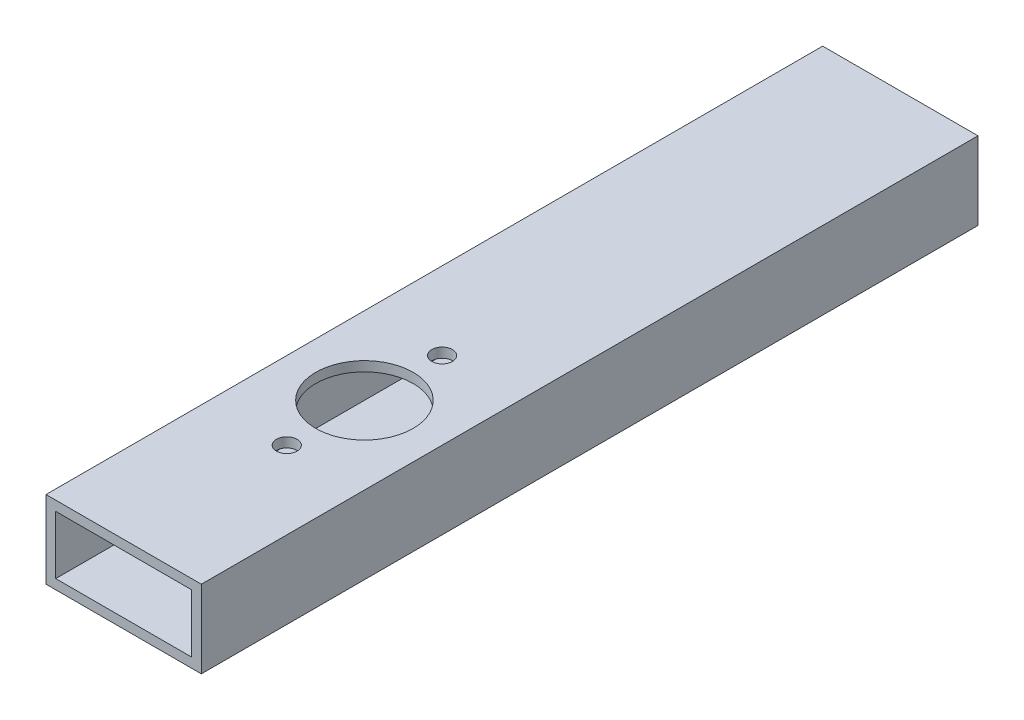
ISO-10303-21;
HEADER;
FILE_DESCRIPTION(('STEP AP214'),'2;1');
FILE_NAME('part.step','',(''),(''),'','','');
FILE_SCHEMA(('AUTOMOTIVE_DESIGN { 1 0 10303 214 1 1 1 1 }'));
ENDSEC;
DATA;
#1=APPLICATION_CONTEXT('core data for automotive mechanical design processes');
#2=APPLICATION_PROTOCOL_DEFINITION('international standard','automotive_design',2000,#1);
#3=PRODUCT_CONTEXT('',#1,'mechanical');
#4=PRODUCT('Part','Part','',(#3));
#5=PRODUCT_RELATED_PRODUCT_CATEGORY('part','',(#4));
#6=PRODUCT_DEFINITION_FORMATION('','',#4);
#7=PRODUCT_DEFINITION_CONTEXT('part definition',#1,'design');
#8=PRODUCT_DEFINITION('design','',#6,#7);
#9=PRODUCT_DEFINITION_SHAPE('','',#8);
#10=(LENGTH_UNIT() NAMED_UNIT(*) SI_UNIT(.MILLI.,.METRE.));
#11=(NAMED_UNIT(*) PLANE_ANGLE_UNIT() SI_UNIT($,.RADIAN.));
#12=(NAMED_UNIT(*) SI_UNIT($,.STERADIAN.) SOLID_ANGLE_UNIT());
#13=UNCERTAINTY_MEASURE_WITH_UNIT(LENGTH_MEASURE(1.E-05),#10,'distance_accuracy_value','');
#14=(GEOMETRIC_REPRESENTATION_CONTEXT(3) GLOBAL_UNCERTAINTY_ASSIGNED_CONTEXT((#13)) GLOBAL_UNIT_ASSIGNED_CONTEXT((#10,
#11,#12)) REPRESENTATION_CONTEXT('',''));
#15=CARTESIAN_POINT('',(0.,0.,0.));
#16=DIRECTION('',(0.,0.,1.));
#17=DIRECTION('',(1.,0.,0.));
#18=AXIS2_PLACEMENT_3D('',#15,#16,#17);
#19=CARTESIAN_POINT('',(0.,-247.572549455374,73.66));
#20=DIRECTION('',(0.,1.,0.));
#21=DIRECTION('',(1.,0.,0.));
#22=AXIS2_PLACEMENT_3D('',#19,#20,#21);
#23=CYLINDRICAL_SURFACE('',#22,3.3782);
#24=CARTESIAN_POINT('',(0.,12.7,73.66));
#25=DIRECTION('',(0.,-1.,0.));
#26=DIRECTION('',(0.,0.,-1.));
#27=AXIS2_PLACEMENT_3D('',#24,#25,#26);
#28=CIRCLE('',#27,3.3782);
#29=CARTESIAN_POINT('',(0.,12.7,70.2818));
#30=VERTEX_POINT('',#29);
#31=EDGE_CURVE('E143',#30,#30,#28,.T.);
#32=ORIENTED_EDGE('',*,*,#31,.F.);
#33=EDGE_LOOP('',(#32));
#34=FACE_BOUND('',#33,.T.);
#35=CARTESIAN_POINT('',(0.,9.52500000000001,73.66));
#36=DIRECTION('',(0.,1.,0.));
#37=DIRECTION('',(1.,0.,0.));
#38=AXIS2_PLACEMENT_3D('',#35,#36,#37);
#39=CIRCLE('',#38,3.3782);
#40=CARTESIAN_POINT('',(3.3782,9.52500000000001,73.66));
#41=VERTEX_POINT('',#40);
#42=EDGE_CURVE('E147',#41,#41,#39,.T.);
#43=ORIENTED_EDGE('',*,*,#42,.F.);
#44=EDGE_LOOP('',(#43));
#45=FACE_BOUND('',#44,.T.);
#46=ADVANCED_FACE('F16',(#34,#45),#23,.F.);
#47=CARTESIAN_POINT('',(0.,-247.572549455374,73.66));
#48=DIRECTION('',(0.,1.,0.));
#49=DIRECTION('',(1.,0.,0.));
#50=AXIS2_PLACEMENT_3D('',#47,#48,#49);
#51=CYLINDRICAL_SURFACE('',#50,3.3782);
#52=CARTESIAN_POINT('',(0.,-9.52500000000001,73.66));
#53=DIRECTION('',(0.,-1.,0.));
#54=DIRECTION('',(0.,0.,-1.));
#55=AXIS2_PLACEMENT_3D('',#52,#53,#54);
#56=CIRCLE('',#55,3.3782);
#57=CARTESIAN_POINT('',(0.,-9.52500000000001,70.2818));
#58=VERTEX_POINT('',#57);
#59=EDGE_CURVE('E139',#58,#58,#56,.T.);
#60=ORIENTED_EDGE('',*,*,#59,.F.);
#61=EDGE_LOOP('',(#60));
#62=FACE_BOUND('',#61,.T.);
#63=CARTESIAN_POINT('',(0.,-12.7,73.66));
#64=DIRECTION('',(0.,1.,0.));
#65=DIRECTION('',(1.,0.,0.));
#66=AXIS2_PLACEMENT_3D('',#63,#64,#65);
#67=CIRCLE('',#66,3.3782);
#68=CARTESIAN_POINT('',(3.3782,-12.7,73.66));
#69=VERTEX_POINT('',#68);
#70=EDGE_CURVE('E129',#69,#69,#67,.T.);
#71=ORIENTED_EDGE('',*,*,#70,.F.);
#72=EDGE_LOOP('',(#71));
#73=FACE_BOUND('',#72,.T.);
#74=ADVANCED_FACE('F192',(#62,#73),#51,.F.);
#75=CARTESIAN_POINT('',(0.,-247.572549455374,22.86));
#76=DIRECTION('',(0.,1.,0.));
#77=DIRECTION('',(1.,0.,0.));
#78=AXIS2_PLACEMENT_3D('',#75,#76,#77);
#79=CYLINDRICAL_SURFACE('',#78,3.3782);
#80=CARTESIAN_POINT('',(0.,12.7,22.86));
#81=DIRECTION('',(0.,-1.,0.));
#82=DIRECTION('',(0.,0.,-1.));
#83=AXIS2_PLACEMENT_3D('',#80,#81,#82);
#84=CIRCLE('',#83,3.3782);
#85=CARTESIAN_POINT('',(0.,12.7,19.4818));
#86=VERTEX_POINT('',#85);
#87=EDGE_CURVE('E105',#86,#86,#84,.T.);
#88=ORIENTED_EDGE('',*,*,#87,.F.);
#89=EDGE_LOOP('',(#88));
#90=FACE_BOUND('',#89,.T.);
#91=CARTESIAN_POINT('',(0.,9.52500000000001,22.86));
#92=DIRECTION('',(0.,1.,0.));
#93=DIRECTION('',(1.,0.,0.));
#94=AXIS2_PLACEMENT_3D('',#91,#92,#93);
#95=CIRCLE('',#94,3.3782);
#96=CARTESIAN_POINT('',(3.3782,9.52500000000001,22.86));
#97=VERTEX_POINT('',#96);
#98=EDGE_CURVE('E144',#97,#97,#95,.T.);
#99=ORIENTED_EDGE('',*,*,#98,.F.);
#100=EDGE_LOOP('',(#99));
#101=FACE_BOUND('',#100,.T.);
#102=ADVANCED_FACE('F199',(#90,#101),#79,.F.);
#103=CARTESIAN_POINT('',(0.,-247.572549455374,22.86));
#104=DIRECTION('',(0.,1.,0.));
#105=DIRECTION('',(1.,0.,0.));
#106=AXIS2_PLACEMENT_3D('',#103,#104,#105);
#107=CYLINDRICAL_SURFACE('',#106,3.3782);
#108=CARTESIAN_POINT('',(0.,-9.52500000000001,22.86));
#109=DIRECTION('',(0.,-1.,0.));
#110=DIRECTION('',(0.,0.,-1.));
#111=AXIS2_PLACEMENT_3D('',#108,#109,#110);
#112=CIRCLE('',#111,3.3782);
#113=CARTESIAN_POINT('',(0.,-9.52500000000001,19.4818));
#114=VERTEX_POINT('',#113);
#115=EDGE_CURVE('E149',#114,#114,#112,.T.);
#116=ORIENTED_EDGE('',*,*,#115,.F.);
#117=EDGE_LOOP('',(#116));
#118=FACE_BOUND('',#117,.T.);
#119=CARTESIAN_POINT('',(0.,-12.7,22.86));
#120=DIRECTION('',(0.,1.,0.));
#121=DIRECTION('',(1.,0.,0.));
#122=AXIS2_PLACEMENT_3D('',#119,#120,#121);
#123=CIRCLE('',#122,3.3782);
#124=CARTESIAN_POINT('',(3.3782,-12.7,22.86));
#125=VERTEX_POINT('',#124);
#126=EDGE_CURVE('E131',#125,#125,#123,.T.);
#127=ORIENTED_EDGE('',*,*,#126,.F.);
#128=EDGE_LOOP('',(#127));
#129=FACE_BOUND('',#128,.T.);
#130=ADVANCED_FACE('F205',(#118,#129),#107,.F.);
#131=CARTESIAN_POINT('',(0.,-12.7,48.26));
#132=DIRECTION('',(0.,1.,0.));
#133=DIRECTION('',(1.,0.,0.));
#134=AXIS2_PLACEMENT_3D('',#131,#132,#133);
#135=CYLINDRICAL_SURFACE('',#134,7.9375);
#136=CARTESIAN_POINT('',(0.,-12.7,48.26));
#137=DIRECTION('',(0.,1.,0.));
#138=DIRECTION('',(1.,0.,0.));
#139=AXIS2_PLACEMENT_3D('',#136,#137,#138);
#140=CIRCLE('',#139,7.9375);
#141=CARTESIAN_POINT('',(7.9375,-12.7,48.26));
#142=VERTEX_POINT('',#141);
#143=EDGE_CURVE('E115',#142,#142,#140,.T.);
#144=ORIENTED_EDGE('',*,*,#143,.F.);
#145=EDGE_LOOP('',(#144));
#146=FACE_BOUND('',#145,.T.);
#147=CARTESIAN_POINT('',(0.,-9.525,48.26));
#148=DIRECTION('',(0.,-1.,0.));
#149=DIRECTION('',(0.,0.,-1.));
#150=AXIS2_PLACEMENT_3D('',#147,#148,#149);
#151=CIRCLE('',#150,7.9375);
#152=CARTESIAN_POINT('',(0.,-9.525,40.3225));
#153=VERTEX_POINT('',#152);
#154=EDGE_CURVE('E151',#153,#153,#151,.T.);
#155=ORIENTED_EDGE('',*,*,#154,.F.);
#156=EDGE_LOOP('',(#155));
#157=FACE_BOUND('',#156,.T.);
#158=ADVANCED_FACE('F209',(#146,#157),#135,.F.);
#159=CARTESIAN_POINT('',(0.,12.7,48.26));
#160=DIRECTION('',(0.,-1.,0.));
#161=DIRECTION('',(0.,0.,-1.));
#162=AXIS2_PLACEMENT_3D('',#159,#160,#161);
#163=CYLINDRICAL_SURFACE('',#162,15.9131);
#164=CARTESIAN_POINT('',(0.,12.7,48.26));
#165=DIRECTION('',(0.,-1.,0.));
#166=DIRECTION('',(0.,0.,-1.));
#167=AXIS2_PLACEMENT_3D('',#164,#165,#166);
#168=CIRCLE('',#167,15.9131);
#169=CARTESIAN_POINT('',(0.,12.7,32.3469));
#170=VERTEX_POINT('',#169);
#171=EDGE_CURVE('E102',#170,#170,#168,.T.);
#172=ORIENTED_EDGE('',*,*,#171,.F.);
#173=EDGE_LOOP('',(#172));
#174=FACE_BOUND('',#173,.T.);
#175=CARTESIAN_POINT('',(0.,9.525,48.26));
#176=DIRECTION('',(0.,1.,0.));
#177=DIRECTION('',(1.,0.,0.));
#178=AXIS2_PLACEMENT_3D('',#175,#176,#177);
#179=CIRCLE('',#178,15.9131);
#180=CARTESIAN_POINT('',(15.9131,9.525,48.26));
#181=VERTEX_POINT('',#180);
#182=EDGE_CURVE('E148',#181,#181,#179,.T.);
#183=ORIENTED_EDGE('',*,*,#182,.F.);
#184=EDGE_LOOP('',(#183));
#185=FACE_BOUND('',#184,.T.);
#186=ADVANCED_FACE('F18',(#174,#185),#163,.F.);
#187=CARTESIAN_POINT('',(22.225,9.525,0.));
#188=DIRECTION('',(1.,0.,0.));
#189=DIRECTION('',(0.,0.,-1.));
#190=AXIS2_PLACEMENT_3D('',#187,#188,#189);
#191=PLANE('',#190);
#192=DIRECTION('',(0.,-1.,0.));
#193=VECTOR('',#192,1.);
#194=CARTESIAN_POINT('',(22.225,4.7625,127.));
#195=LINE('',#194,#193);
#196=CARTESIAN_POINT('',(22.225,9.525,127.));
#197=VERTEX_POINT('',#196);
#198=CARTESIAN_POINT('',(22.225,-9.525,127.));
#199=VERTEX_POINT('',#198);
#200=EDGE_CURVE('E34',#197,#199,#195,.T.);
#201=ORIENTED_EDGE('',*,*,#200,.F.);
#202=DIRECTION('',(0.,0.,-1.));
#203=VECTOR('',#202,1.);
#204=CARTESIAN_POINT('',(22.225,9.525,0.));
#205=LINE('',#204,#203);
#206=CARTESIAN_POINT('',(22.225,9.525,-127.));
#207=VERTEX_POINT('',#206);
#208=EDGE_CURVE('E10',#197,#207,#205,.T.);
#209=ORIENTED_EDGE('',*,*,#208,.T.);
#210=DIRECTION('',(0.,1.,0.));
#211=VECTOR('',#210,1.);
#212=CARTESIAN_POINT('',(22.225,4.7625,-127.));
#213=LINE('',#212,#211);
#214=CARTESIAN_POINT('',(22.225,-9.525,-127.));
#215=VERTEX_POINT('',#214);
#216=EDGE_CURVE('E160',#215,#207,#213,.T.);
#217=ORIENTED_EDGE('',*,*,#216,.F.);
#218=DIRECTION('',(0.,0.,1.));
#219=VECTOR('',#218,1.);
#220=CARTESIAN_POINT('',(22.225,-9.525,0.));
#221=LINE('',#220,#219);
#222=EDGE_CURVE('E26',#215,#199,#221,.T.);
#223=ORIENTED_EDGE('',*,*,#222,.T.);
#224=EDGE_LOOP('',(#201,#209,#217,#223));
#225=FACE_BOUND('',#224,.T.);
#226=ADVANCED_FACE('F211',(#225),#191,.F.);
#227=CARTESIAN_POINT('',(22.225,-9.525,0.));
#228=DIRECTION('',(0.,-1.,0.));
#229=DIRECTION('',(0.,0.,-1.));
#230=AXIS2_PLACEMENT_3D('',#227,#228,#229);
#231=PLANE('',#230);
#232=ORIENTED_EDGE('',*,*,#59,.T.);
#233=EDGE_LOOP('',(#232));
#234=FACE_BOUND('',#233,.T.);
#235=ORIENTED_EDGE('',*,*,#115,.T.);
#236=EDGE_LOOP('',(#235));
#237=FACE_BOUND('',#236,.T.);
#238=ORIENTED_EDGE('',*,*,#154,.T.);
#239=EDGE_LOOP('',(#238));
#240=FACE_BOUND('',#239,.T.);
#241=DIRECTION('',(-1.,0.,0.));
#242=VECTOR('',#241,1.);
#243=CARTESIAN_POINT('',(11.1125,-9.525,127.));
#244=LINE('',#243,#242);
#245=CARTESIAN_POINT('',(-22.225,-9.525,127.));
#246=VERTEX_POINT('',#245);
#247=EDGE_CURVE('E161',#199,#246,#244,.T.);
#248=ORIENTED_EDGE('',*,*,#247,.F.);
#249=ORIENTED_EDGE('',*,*,#222,.F.);
#250=DIRECTION('',(1.,0.,0.));
#251=VECTOR('',#250,1.);
#252=CARTESIAN_POINT('',(11.1125,-9.525,-127.));
#253=LINE('',#252,#251);
#254=CARTESIAN_POINT('',(-22.225,-9.525,-127.));
#255=VERTEX_POINT('',#254);
#256=EDGE_CURVE('E122',#255,#215,#253,.T.);
#257=ORIENTED_EDGE('',*,*,#256,.F.);
#258=DIRECTION('',(0.,0.,1.));
#259=VECTOR('',#258,1.);
#260=CARTESIAN_POINT('',(-22.225,-9.525,0.));
#261=LINE('',#260,#259);
#262=EDGE_CURVE('E156',#255,#246,#261,.T.);
#263=ORIENTED_EDGE('',*,*,#262,.T.);
#264=EDGE_LOOP('',(#248,#249,#257,#263));
#265=FACE_BOUND('',#264,.T.);
#266=ADVANCED_FACE('F214',(#234,#237,#240,#265),#231,.F.);
#267=CARTESIAN_POINT('',(-22.225,-9.525,0.));
#268=DIRECTION('',(-1.,0.,0.));
#269=DIRECTION('',(0.,0.,1.));
#270=AXIS2_PLACEMENT_3D('',#267,#268,#269);
#271=PLANE('',#270);
#272=DIRECTION('',(0.,1.,0.));
#273=VECTOR('',#272,1.);
#274=CARTESIAN_POINT('',(-22.225,-4.7625,127.));
#275=LINE('',#274,#273);
#276=CARTESIAN_POINT('',(-22.225,9.525,127.));
#277=VERTEX_POINT('',#276);
#278=EDGE_CURVE('E166',#246,#277,#275,.T.);
#279=ORIENTED_EDGE('',*,*,#278,.F.);
#280=ORIENTED_EDGE('',*,*,#262,.F.);
#281=DIRECTION('',(0.,-1.,0.));
#282=VECTOR('',#281,1.);
#283=CARTESIAN_POINT('',(-22.225,-4.7625,-127.));
#284=LINE('',#283,#282);
#285=CARTESIAN_POINT('',(-22.225,9.525,-127.));
#286=VERTEX_POINT('',#285);
#287=EDGE_CURVE('E126',#286,#255,#284,.T.);
#288=ORIENTED_EDGE('',*,*,#287,.F.);
#289=DIRECTION('',(0.,0.,1.));
#290=VECTOR('',#289,1.);
#291=CARTESIAN_POINT('',(-22.225,9.525,0.));
#292=LINE('',#291,#290);
#293=EDGE_CURVE('E170',#286,#277,#292,.T.);
#294=ORIENTED_EDGE('',*,*,#293,.T.);
#295=EDGE_LOOP('',(#279,#280,#288,#294));
#296=FACE_BOUND('',#295,.T.);
#297=ADVANCED_FACE('F217',(#296),#271,.F.);
#298=CARTESIAN_POINT('',(-22.225,9.525,0.));
#299=DIRECTION('',(0.,1.,0.));
#300=DIRECTION('',(0.,0.,1.));
#301=AXIS2_PLACEMENT_3D('',#298,#299,#300);
#302=PLANE('',#301);
#303=ORIENTED_EDGE('',*,*,#42,.T.);
#304=EDGE_LOOP('',(#303));
#305=FACE_BOUND('',#304,.T.);
#306=ORIENTED_EDGE('',*,*,#98,.T.);
#307=EDGE_LOOP('',(#306));
#308=FACE_BOUND('',#307,.T.);
#309=ORIENTED_EDGE('',*,*,#182,.T.);
#310=EDGE_LOOP('',(#309));
#311=FACE_BOUND('',#310,.T.);
#312=DIRECTION('',(1.,0.,0.));
#313=VECTOR('',#312,1.);
#314=CARTESIAN_POINT('',(-11.1125,9.525,127.));
#315=LINE('',#314,#313);
#316=EDGE_CURVE('E172',#277,#197,#315,.T.);
#317=ORIENTED_EDGE('',*,*,#316,.F.);
#318=ORIENTED_EDGE('',*,*,#293,.F.);
#319=DIRECTION('',(-1.,0.,0.));
#320=VECTOR('',#319,1.);
#321=CARTESIAN_POINT('',(-11.1125,9.525,-127.));
#322=LINE('',#321,#320);
#323=EDGE_CURVE('E164',#207,#286,#322,.T.);
#324=ORIENTED_EDGE('',*,*,#323,.F.);
#325=ORIENTED_EDGE('',*,*,#208,.F.);
#326=EDGE_LOOP('',(#317,#318,#324,#325));
#327=FACE_BOUND('',#326,.T.);
#328=ADVANCED_FACE('F188',(#305,#308,#311,#327),#302,.F.);
#329=CARTESIAN_POINT('',(0.,0.,-127.));
#330=DIRECTION('',(0.,0.,1.));
#331=DIRECTION('',(1.,0.,0.));
#332=AXIS2_PLACEMENT_3D('',#329,#330,#331);
#333=PLANE('',#332);
#334=ORIENTED_EDGE('',*,*,#216,.T.);
#335=ORIENTED_EDGE('',*,*,#323,.T.);
#336=ORIENTED_EDGE('',*,*,#287,.T.);
#337=ORIENTED_EDGE('',*,*,#256,.T.);
#338=EDGE_LOOP('',(#334,#335,#336,#337));
#339=FACE_BOUND('',#338,.T.);
#340=DIRECTION('',(0.,-1.,0.));
#341=VECTOR('',#340,1.);
#342=CARTESIAN_POINT('',(-25.4,-12.7,-127.));
#343=LINE('',#342,#341);
#344=CARTESIAN_POINT('',(-25.4,12.7,-127.));
#345=VERTEX_POINT('',#344);
#346=CARTESIAN_POINT('',(-25.4,-12.7,-127.));
#347=VERTEX_POINT('',#346);
#348=EDGE_CURVE('E96',#345,#347,#343,.T.);
#349=ORIENTED_EDGE('',*,*,#348,.F.);
#350=DIRECTION('',(-1.,0.,0.));
#351=VECTOR('',#350,1.);
#352=CARTESIAN_POINT('',(-25.4,12.7,-127.));
#353=LINE('',#352,#351);
#354=CARTESIAN_POINT('',(25.4,12.7,-127.));
#355=VERTEX_POINT('',#354);
#356=EDGE_CURVE('E88',#355,#345,#353,.T.);
#357=ORIENTED_EDGE('',*,*,#356,.F.);
#358=DIRECTION('',(0.,1.,0.));
#359=VECTOR('',#358,1.);
#360=CARTESIAN_POINT('',(25.4,12.7,-127.));
#361=LINE('',#360,#359);
#362=CARTESIAN_POINT('',(25.4,-12.7,-127.));
#363=VERTEX_POINT('',#362);
#364=EDGE_CURVE('E121',#363,#355,#361,.T.);
#365=ORIENTED_EDGE('',*,*,#364,.F.);
#366=DIRECTION('',(1.,0.,0.));
#367=VECTOR('',#366,1.);
#368=CARTESIAN_POINT('',(25.4,-12.7,-127.));
#369=LINE('',#368,#367);
#370=EDGE_CURVE('E95',#347,#363,#369,.T.);
#371=ORIENTED_EDGE('',*,*,#370,.F.);
#372=EDGE_LOOP('',(#349,#357,#365,#371));
#373=FACE_BOUND('',#372,.T.);
#374=ADVANCED_FACE('F224',(#339,#373),#333,.F.);
#375=CARTESIAN_POINT('',(25.4,12.7,0.));
#376=DIRECTION('',(1.,0.,0.));
#377=DIRECTION('',(0.,0.,-1.));
#378=AXIS2_PLACEMENT_3D('',#375,#376,#377);
#379=PLANE('',#378);
#380=DIRECTION('',(0.,-1.,0.));
#381=VECTOR('',#380,1.);
#382=CARTESIAN_POINT('',(25.4,12.7,127.));
#383=LINE('',#382,#381);
#384=CARTESIAN_POINT('',(25.4,12.7,127.));
#385=VERTEX_POINT('',#384);
#386=CARTESIAN_POINT('',(25.4,-12.7,127.));
#387=VERTEX_POINT('',#386);
#388=EDGE_CURVE('E101',#385,#387,#383,.T.);
#389=ORIENTED_EDGE('',*,*,#388,.T.);
#390=DIRECTION('',(0.,0.,-1.));
#391=VECTOR('',#390,1.);
#392=CARTESIAN_POINT('',(25.4,-12.7,0.));
#393=LINE('',#392,#391);
#394=EDGE_CURVE('E111',#387,#363,#393,.T.);
#395=ORIENTED_EDGE('',*,*,#394,.T.);
#396=ORIENTED_EDGE('',*,*,#364,.T.);
#397=DIRECTION('',(0.,0.,-1.));
#398=VECTOR('',#397,1.);
#399=CARTESIAN_POINT('',(25.4,12.7,0.));
#400=LINE('',#399,#398);
#401=EDGE_CURVE('E103',#385,#355,#400,.T.);
#402=ORIENTED_EDGE('',*,*,#401,.F.);
#403=EDGE_LOOP('',(#389,#395,#396,#402));
#404=FACE_BOUND('',#403,.T.);
#405=ADVANCED_FACE('F227',(#404),#379,.T.);
#406=CARTESIAN_POINT('',(25.4,-12.7,0.));
#407=DIRECTION('',(0.,-1.,0.));
#408=DIRECTION('',(0.,0.,-1.));
#409=AXIS2_PLACEMENT_3D('',#406,#407,#408);
#410=PLANE('',#409);
#411=ORIENTED_EDGE('',*,*,#70,.T.);
#412=EDGE_LOOP('',(#411));
#413=FACE_BOUND('',#412,.T.);
#414=ORIENTED_EDGE('',*,*,#126,.T.);
#415=EDGE_LOOP('',(#414));
#416=FACE_BOUND('',#415,.T.);
#417=ORIENTED_EDGE('',*,*,#143,.T.);
#418=EDGE_LOOP('',(#417));
#419=FACE_BOUND('',#418,.T.);
#420=DIRECTION('',(-1.,0.,0.));
#421=VECTOR('',#420,1.);
#422=CARTESIAN_POINT('',(25.4,-12.7,127.));
#423=LINE('',#422,#421);
#424=CARTESIAN_POINT('',(-25.4,-12.7,127.));
#425=VERTEX_POINT('',#424);
#426=EDGE_CURVE('E113',#387,#425,#423,.T.);
#427=ORIENTED_EDGE('',*,*,#426,.T.);
#428=DIRECTION('',(0.,0.,-1.));
#429=VECTOR('',#428,1.);
#430=CARTESIAN_POINT('',(-25.4,-12.7,0.));
#431=LINE('',#430,#429);
#432=EDGE_CURVE('E78',#425,#347,#431,.T.);
#433=ORIENTED_EDGE('',*,*,#432,.T.);
#434=ORIENTED_EDGE('',*,*,#370,.T.);
#435=ORIENTED_EDGE('',*,*,#394,.F.);
#436=EDGE_LOOP('',(#427,#433,#434,#435));
#437=FACE_BOUND('',#436,.T.);
#438=ADVANCED_FACE('F231',(#413,#416,#419,#437),#410,.T.);
#439=CARTESIAN_POINT('',(-25.4,-12.7,0.));
#440=DIRECTION('',(-1.,0.,0.));
#441=DIRECTION('',(0.,0.,1.));
#442=AXIS2_PLACEMENT_3D('',#439,#440,#441);
#443=PLANE('',#442);
#444=DIRECTION('',(0.,1.,0.));
#445=VECTOR('',#444,1.);
#446=CARTESIAN_POINT('',(-25.4,-12.7,127.));
#447=LINE('',#446,#445);
#448=CARTESIAN_POINT('',(-25.4,12.7,127.));
#449=VERTEX_POINT('',#448);
#450=EDGE_CURVE('E91',#425,#449,#447,.T.);
#451=ORIENTED_EDGE('',*,*,#450,.T.);
#452=DIRECTION('',(0.,0.,1.));
#453=VECTOR('',#452,1.);
#454=CARTESIAN_POINT('',(-25.4,12.7,0.));
#455=LINE('',#454,#453);
#456=EDGE_CURVE('E84',#345,#449,#455,.T.);
#457=ORIENTED_EDGE('',*,*,#456,.F.);
#458=ORIENTED_EDGE('',*,*,#348,.T.);
#459=ORIENTED_EDGE('',*,*,#432,.F.);
#460=EDGE_LOOP('',(#451,#457,#458,#459));
#461=FACE_BOUND('',#460,.T.);
#462=ADVANCED_FACE('F92',(#461),#443,.T.);
#463=CARTESIAN_POINT('',(-25.4,12.7,0.));
#464=DIRECTION('',(0.,1.,0.));
#465=DIRECTION('',(0.,0.,1.));
#466=AXIS2_PLACEMENT_3D('',#463,#464,#465);
#467=PLANE('',#466);
#468=ORIENTED_EDGE('',*,*,#31,.T.);
#469=EDGE_LOOP('',(#468));
#470=FACE_BOUND('',#469,.T.);
#471=ORIENTED_EDGE('',*,*,#87,.T.);
#472=EDGE_LOOP('',(#471));
#473=FACE_BOUND('',#472,.T.);
#474=ORIENTED_EDGE('',*,*,#171,.T.);
#475=EDGE_LOOP('',(#474));
#476=FACE_BOUND('',#475,.T.);
#477=DIRECTION('',(1.,0.,0.));
#478=VECTOR('',#477,1.);
#479=CARTESIAN_POINT('',(-25.4,12.7,127.));
#480=LINE('',#479,#478);
#481=EDGE_CURVE('E20',#449,#385,#480,.T.);
#482=ORIENTED_EDGE('',*,*,#481,.T.);
#483=ORIENTED_EDGE('',*,*,#401,.T.);
#484=ORIENTED_EDGE('',*,*,#356,.T.);
#485=ORIENTED_EDGE('',*,*,#456,.T.);
#486=EDGE_LOOP('',(#482,#483,#484,#485));
#487=FACE_BOUND('',#486,.T.);
#488=ADVANCED_FACE('F85',(#470,#473,#476,#487),#467,.T.);
#489=CARTESIAN_POINT('',(0.,0.,127.));
#490=DIRECTION('',(0.,0.,1.));
#491=DIRECTION('',(1.,0.,0.));
#492=AXIS2_PLACEMENT_3D('',#489,#490,#491);
#493=PLANE('',#492);
#494=ORIENTED_EDGE('',*,*,#200,.T.);
#495=ORIENTED_EDGE('',*,*,#247,.T.);
#496=ORIENTED_EDGE('',*,*,#278,.T.);
#497=ORIENTED_EDGE('',*,*,#316,.T.);
#498=EDGE_LOOP('',(#494,#495,#496,#497));
#499=FACE_BOUND('',#498,.T.);
#500=ORIENTED_EDGE('',*,*,#388,.F.);
#501=ORIENTED_EDGE('',*,*,#481,.F.);
#502=ORIENTED_EDGE('',*,*,#450,.F.);
#503=ORIENTED_EDGE('',*,*,#426,.F.);
#504=EDGE_LOOP('',(#500,#501,#502,#503));
#505=FACE_BOUND('',#504,.T.);
#506=ADVANCED_FACE('F99',(#499,#505),#493,.T.);
#507=CLOSED_SHELL('',(#46,#74,#102,#130,#158,#186,#226,#266,#297,#328,#374,#405,#438,#462,#488,#506));
#508=MANIFOLD_SOLID_BREP('B1',#507);
#509=ADVANCED_BREP_SHAPE_REPRESENTATION('',(#18,#508),#14);
#510=SHAPE_DEFINITION_REPRESENTATION(#9,#509);
ENDSEC;
END-ISO-10303-21;
